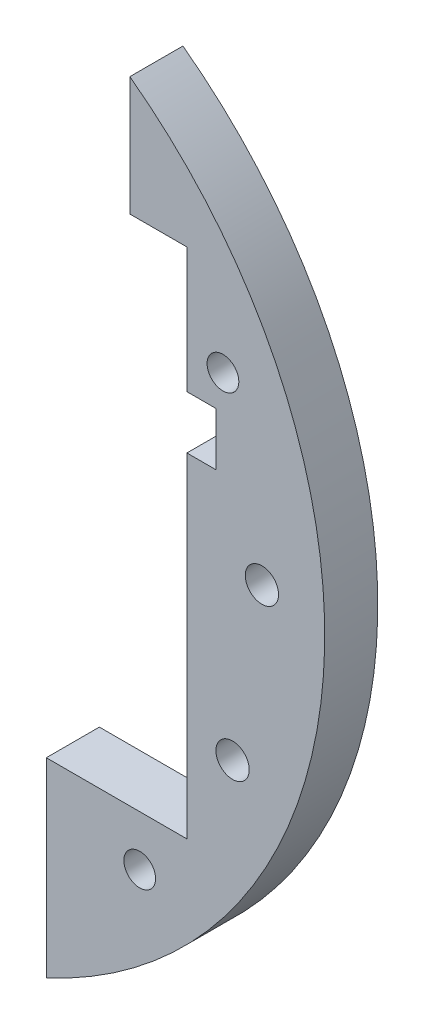
ISO-10303-21;
HEADER;
FILE_DESCRIPTION(('STEP AP214'),'2;1');
FILE_NAME('part.step','',(''),(''),'','','');
FILE_SCHEMA(('AUTOMOTIVE_DESIGN { 1 0 10303 214 1 1 1 1 }'));
ENDSEC;
DATA;
#1=APPLICATION_CONTEXT('core data for automotive mechanical design processes');
#2=APPLICATION_PROTOCOL_DEFINITION('international standard','automotive_design',2000,#1);
#3=PRODUCT_CONTEXT('',#1,'mechanical');
#4=PRODUCT('Part','Part','',(#3));
#5=PRODUCT_RELATED_PRODUCT_CATEGORY('part','',(#4));
#6=PRODUCT_DEFINITION_FORMATION('','',#4);
#7=PRODUCT_DEFINITION_CONTEXT('part definition',#1,'design');
#8=PRODUCT_DEFINITION('design','',#6,#7);
#9=PRODUCT_DEFINITION_SHAPE('','',#8);
#10=(LENGTH_UNIT() NAMED_UNIT(*) SI_UNIT(.MILLI.,.METRE.));
#11=(NAMED_UNIT(*) PLANE_ANGLE_UNIT() SI_UNIT($,.RADIAN.));
#12=(NAMED_UNIT(*) SI_UNIT($,.STERADIAN.) SOLID_ANGLE_UNIT());
#13=UNCERTAINTY_MEASURE_WITH_UNIT(LENGTH_MEASURE(1.E-05),#10,'distance_accuracy_value','');
#14=(GEOMETRIC_REPRESENTATION_CONTEXT(3) GLOBAL_UNCERTAINTY_ASSIGNED_CONTEXT((#13)) GLOBAL_UNIT_ASSIGNED_CONTEXT((#10,
#11,#12)) REPRESENTATION_CONTEXT('',''));
#15=CARTESIAN_POINT('',(0.,0.,0.));
#16=DIRECTION('',(0.,0.,1.));
#17=DIRECTION('',(1.,0.,0.));
#18=AXIS2_PLACEMENT_3D('',#15,#16,#17);
#19=CARTESIAN_POINT('',(41.,32.,6.35));
#20=DIRECTION('',(0.,-1.,0.));
#21=DIRECTION('',(0.,0.,-1.));
#22=AXIS2_PLACEMENT_3D('',#19,#20,#21);
#23=PLANE('',#22);
#24=DIRECTION('',(0.,0.,1.));
#25=VECTOR('',#24,1.);
#26=CARTESIAN_POINT('',(34.175,32.,6.35));
#27=LINE('',#26,#25);
#28=CARTESIAN_POINT('',(34.175,32.,0.));
#29=VERTEX_POINT('',#28);
#30=CARTESIAN_POINT('',(34.175,32.,6.35));
#31=VERTEX_POINT('',#30);
#32=EDGE_CURVE('E43',#29,#31,#27,.T.);
#33=ORIENTED_EDGE('',*,*,#32,.F.);
#34=DIRECTION('',(-1.,0.,0.));
#35=VECTOR('',#34,1.);
#36=CARTESIAN_POINT('',(41.,32.,0.));
#37=LINE('',#36,#35);
#38=CARTESIAN_POINT('',(41.,32.,0.));
#39=VERTEX_POINT('',#38);
#40=EDGE_CURVE('E173',#39,#29,#37,.T.);
#41=ORIENTED_EDGE('',*,*,#40,.F.);
#42=DIRECTION('',(0.,0.,-1.));
#43=VECTOR('',#42,1.);
#44=CARTESIAN_POINT('',(41.,32.,6.35));
#45=LINE('',#44,#43);
#46=CARTESIAN_POINT('',(41.,32.,6.35));
#47=VERTEX_POINT('',#46);
#48=EDGE_CURVE('E170',#47,#39,#45,.T.);
#49=ORIENTED_EDGE('',*,*,#48,.F.);
#50=DIRECTION('',(-1.,0.,0.));
#51=VECTOR('',#50,1.);
#52=CARTESIAN_POINT('',(41.,32.,6.35));
#53=LINE('',#52,#51);
#54=EDGE_CURVE('E172',#47,#31,#53,.T.);
#55=ORIENTED_EDGE('',*,*,#54,.T.);
#56=EDGE_LOOP('',(#33,#41,#49,#55));
#57=FACE_BOUND('',#56,.T.);
#58=ADVANCED_FACE('F35',(#57),#23,.T.);
#59=CARTESIAN_POINT('',(41.,17.,6.35));
#60=DIRECTION('',(-1.,0.,0.));
#61=DIRECTION('',(0.,0.,1.));
#62=AXIS2_PLACEMENT_3D('',#59,#60,#61);
#63=PLANE('',#62);
#64=DIRECTION('',(0.,1.,0.));
#65=VECTOR('',#64,1.);
#66=CARTESIAN_POINT('',(41.,17.,0.));
#67=LINE('',#66,#65);
#68=CARTESIAN_POINT('',(41.,17.,0.));
#69=VERTEX_POINT('',#68);
#70=EDGE_CURVE('E176',#69,#39,#67,.T.);
#71=ORIENTED_EDGE('',*,*,#70,.F.);
#72=DIRECTION('',(0.,0.,-1.));
#73=VECTOR('',#72,1.);
#74=CARTESIAN_POINT('',(41.,17.,6.35));
#75=LINE('',#74,#73);
#76=CARTESIAN_POINT('',(41.,17.,6.35));
#77=VERTEX_POINT('',#76);
#78=EDGE_CURVE('E168',#77,#69,#75,.T.);
#79=ORIENTED_EDGE('',*,*,#78,.F.);
#80=DIRECTION('',(0.,1.,0.));
#81=VECTOR('',#80,1.);
#82=CARTESIAN_POINT('',(41.,17.,6.35));
#83=LINE('',#82,#81);
#84=EDGE_CURVE('E195',#77,#47,#83,.T.);
#85=ORIENTED_EDGE('',*,*,#84,.T.);
#86=ORIENTED_EDGE('',*,*,#48,.T.);
#87=EDGE_LOOP('',(#71,#79,#85,#86));
#88=FACE_BOUND('',#87,.T.);
#89=ADVANCED_FACE('F237',(#88),#63,.T.);
#90=CARTESIAN_POINT('',(44.5,17.,6.35));
#91=DIRECTION('',(0.,-1.,0.));
#92=DIRECTION('',(0.,0.,-1.));
#93=AXIS2_PLACEMENT_3D('',#90,#91,#92);
#94=PLANE('',#93);
#95=DIRECTION('',(-1.,0.,0.));
#96=VECTOR('',#95,1.);
#97=CARTESIAN_POINT('',(44.5,17.,0.));
#98=LINE('',#97,#96);
#99=CARTESIAN_POINT('',(44.5,17.,0.));
#100=VERTEX_POINT('',#99);
#101=EDGE_CURVE('E179',#100,#69,#98,.T.);
#102=ORIENTED_EDGE('',*,*,#101,.F.);
#103=DIRECTION('',(0.,0.,-1.));
#104=VECTOR('',#103,1.);
#105=CARTESIAN_POINT('',(44.5,17.,6.35));
#106=LINE('',#105,#104);
#107=CARTESIAN_POINT('',(44.5,17.,6.35));
#108=VERTEX_POINT('',#107);
#109=EDGE_CURVE('E166',#108,#100,#106,.T.);
#110=ORIENTED_EDGE('',*,*,#109,.F.);
#111=DIRECTION('',(-1.,0.,0.));
#112=VECTOR('',#111,1.);
#113=CARTESIAN_POINT('',(44.5,17.,6.35));
#114=LINE('',#113,#112);
#115=EDGE_CURVE('E197',#108,#77,#114,.T.);
#116=ORIENTED_EDGE('',*,*,#115,.T.);
#117=ORIENTED_EDGE('',*,*,#78,.T.);
#118=EDGE_LOOP('',(#102,#110,#116,#117));
#119=FACE_BOUND('',#118,.T.);
#120=ADVANCED_FACE('F232',(#119),#94,.T.);
#121=CARTESIAN_POINT('',(44.5,10.65,6.35));
#122=DIRECTION('',(-1.,0.,0.));
#123=DIRECTION('',(0.,0.,1.));
#124=AXIS2_PLACEMENT_3D('',#121,#122,#123);
#125=PLANE('',#124);
#126=DIRECTION('',(0.,1.,0.));
#127=VECTOR('',#126,1.);
#128=CARTESIAN_POINT('',(44.5,10.65,0.));
#129=LINE('',#128,#127);
#130=CARTESIAN_POINT('',(44.5,10.65,0.));
#131=VERTEX_POINT('',#130);
#132=EDGE_CURVE('E182',#131,#100,#129,.T.);
#133=ORIENTED_EDGE('',*,*,#132,.F.);
#134=DIRECTION('',(0.,0.,-1.));
#135=VECTOR('',#134,1.);
#136=CARTESIAN_POINT('',(44.5,10.65,6.35));
#137=LINE('',#136,#135);
#138=CARTESIAN_POINT('',(44.5,10.65,6.35));
#139=VERTEX_POINT('',#138);
#140=EDGE_CURVE('E164',#139,#131,#137,.T.);
#141=ORIENTED_EDGE('',*,*,#140,.F.);
#142=DIRECTION('',(0.,1.,0.));
#143=VECTOR('',#142,1.);
#144=CARTESIAN_POINT('',(44.5,10.65,6.35));
#145=LINE('',#144,#143);
#146=EDGE_CURVE('E199',#139,#108,#145,.T.);
#147=ORIENTED_EDGE('',*,*,#146,.T.);
#148=ORIENTED_EDGE('',*,*,#109,.T.);
#149=EDGE_LOOP('',(#133,#141,#147,#148));
#150=FACE_BOUND('',#149,.T.);
#151=ADVANCED_FACE('F227',(#150),#125,.T.);
#152=CARTESIAN_POINT('',(41.,10.65,6.35));
#153=DIRECTION('',(0.,1.,0.));
#154=DIRECTION('',(-1.,0.,0.));
#155=AXIS2_PLACEMENT_3D('',#152,#153,#154);
#156=PLANE('',#155);
#157=DIRECTION('',(1.,0.,0.));
#158=VECTOR('',#157,1.);
#159=CARTESIAN_POINT('',(41.,10.65,0.));
#160=LINE('',#159,#158);
#161=CARTESIAN_POINT('',(41.,10.65,0.));
#162=VERTEX_POINT('',#161);
#163=EDGE_CURVE('E185',#162,#131,#160,.T.);
#164=ORIENTED_EDGE('',*,*,#163,.F.);
#165=DIRECTION('',(0.,0.,-1.));
#166=VECTOR('',#165,1.);
#167=CARTESIAN_POINT('',(41.,10.65,6.35));
#168=LINE('',#167,#166);
#169=CARTESIAN_POINT('',(41.,10.65,6.35));
#170=VERTEX_POINT('',#169);
#171=EDGE_CURVE('E162',#170,#162,#168,.T.);
#172=ORIENTED_EDGE('',*,*,#171,.F.);
#173=DIRECTION('',(1.,0.,0.));
#174=VECTOR('',#173,1.);
#175=CARTESIAN_POINT('',(41.,10.65,6.35));
#176=LINE('',#175,#174);
#177=EDGE_CURVE('E201',#170,#139,#176,.T.);
#178=ORIENTED_EDGE('',*,*,#177,.T.);
#179=ORIENTED_EDGE('',*,*,#140,.T.);
#180=EDGE_LOOP('',(#164,#172,#178,#179));
#181=FACE_BOUND('',#180,.T.);
#182=ADVANCED_FACE('F222',(#181),#156,.T.);
#183=CARTESIAN_POINT('',(45.3153893518326,21.1309130870348,6.35));
#184=DIRECTION('',(0.,0.,-1.));
#185=DIRECTION('',(-1.,0.,0.));
#186=AXIS2_PLACEMENT_3D('',#183,#184,#185);
#187=CYLINDRICAL_SURFACE('',#186,1.89865);
#188=CARTESIAN_POINT('',(45.3153893518326,21.1309130870348,6.35));
#189=DIRECTION('',(0.,0.,1.));
#190=DIRECTION('',(1.,0.,0.));
#191=AXIS2_PLACEMENT_3D('',#188,#189,#190);
#192=CIRCLE('',#191,1.89865);
#193=CARTESIAN_POINT('',(47.2140393518326,21.1309130870348,6.35));
#194=VERTEX_POINT('',#193);
#195=EDGE_CURVE('E133',#194,#194,#192,.T.);
#196=ORIENTED_EDGE('',*,*,#195,.T.);
#197=EDGE_LOOP('',(#196));
#198=FACE_BOUND('',#197,.T.);
#199=CARTESIAN_POINT('',(45.3153893518326,21.1309130870348,0.));
#200=DIRECTION('',(0.,0.,1.));
#201=DIRECTION('',(1.,0.,0.));
#202=AXIS2_PLACEMENT_3D('',#199,#200,#201);
#203=CIRCLE('',#202,1.89865);
#204=CARTESIAN_POINT('',(47.2140393518326,21.1309130870348,0.));
#205=VERTEX_POINT('',#204);
#206=EDGE_CURVE('E136',#205,#205,#203,.T.);
#207=ORIENTED_EDGE('',*,*,#206,.F.);
#208=EDGE_LOOP('',(#207));
#209=FACE_BOUND('',#208,.T.);
#210=ADVANCED_FACE('F267',(#198,#209),#187,.F.);
#211=CARTESIAN_POINT('',(46.4673762113411,-18.4603073656341,6.35));
#212=DIRECTION('',(0.,0.,-1.));
#213=DIRECTION('',(-1.,0.,0.));
#214=AXIS2_PLACEMENT_3D('',#211,#212,#213);
#215=CYLINDRICAL_SURFACE('',#214,1.9939);
#216=CARTESIAN_POINT('',(46.4673762113411,-18.4603073656341,6.35));
#217=DIRECTION('',(0.,0.,1.));
#218=DIRECTION('',(1.,0.,0.));
#219=AXIS2_PLACEMENT_3D('',#216,#217,#218);
#220=CIRCLE('',#219,1.9939);
#221=CARTESIAN_POINT('',(48.4612762113412,-18.4603073656341,6.35));
#222=VERTEX_POINT('',#221);
#223=EDGE_CURVE('E139',#222,#222,#220,.T.);
#224=ORIENTED_EDGE('',*,*,#223,.T.);
#225=EDGE_LOOP('',(#224));
#226=FACE_BOUND('',#225,.T.);
#227=CARTESIAN_POINT('',(46.4673762113411,-18.4603073656341,0.));
#228=DIRECTION('',(0.,0.,1.));
#229=DIRECTION('',(1.,0.,0.));
#230=AXIS2_PLACEMENT_3D('',#227,#228,#229);
#231=CIRCLE('',#230,1.9939);
#232=CARTESIAN_POINT('',(48.4612762113412,-18.4603073656341,0.));
#233=VERTEX_POINT('',#232);
#234=EDGE_CURVE('E142',#233,#233,#231,.T.);
#235=ORIENTED_EDGE('',*,*,#234,.F.);
#236=EDGE_LOOP('',(#235));
#237=FACE_BOUND('',#236,.T.);
#238=ADVANCED_FACE('F273',(#226,#237),#215,.F.);
#239=CARTESIAN_POINT('',(49.97884750411,1.45423593715533,6.35));
#240=DIRECTION('',(0.,0.,-1.));
#241=DIRECTION('',(-1.,0.,0.));
#242=AXIS2_PLACEMENT_3D('',#239,#240,#241);
#243=CYLINDRICAL_SURFACE('',#242,1.9939);
#244=CARTESIAN_POINT('',(49.97884750411,1.45423593715533,6.35));
#245=DIRECTION('',(0.,0.,1.));
#246=DIRECTION('',(1.,0.,0.));
#247=AXIS2_PLACEMENT_3D('',#244,#245,#246);
#248=CIRCLE('',#247,1.9939);
#249=CARTESIAN_POINT('',(51.97274750411,1.45423593715533,6.35));
#250=VERTEX_POINT('',#249);
#251=EDGE_CURVE('E145',#250,#250,#248,.T.);
#252=ORIENTED_EDGE('',*,*,#251,.T.);
#253=EDGE_LOOP('',(#252));
#254=FACE_BOUND('',#253,.T.);
#255=CARTESIAN_POINT('',(49.97884750411,1.45423593715533,0.));
#256=DIRECTION('',(0.,0.,1.));
#257=DIRECTION('',(1.,0.,0.));
#258=AXIS2_PLACEMENT_3D('',#255,#256,#257);
#259=CIRCLE('',#258,1.9939);
#260=CARTESIAN_POINT('',(51.97274750411,1.45423593715533,0.));
#261=VERTEX_POINT('',#260);
#262=EDGE_CURVE('E148',#261,#261,#259,.T.);
#263=ORIENTED_EDGE('',*,*,#262,.F.);
#264=EDGE_LOOP('',(#263));
#265=FACE_BOUND('',#264,.T.);
#266=ADVANCED_FACE('F251',(#254,#265),#243,.F.);
#267=CARTESIAN_POINT('',(35.3553390593274,-35.3553390593274,6.35));
#268=DIRECTION('',(0.,0.,-1.));
#269=DIRECTION('',(-1.,0.,0.));
#270=AXIS2_PLACEMENT_3D('',#267,#268,#269);
#271=CYLINDRICAL_SURFACE('',#270,1.89865);
#272=CARTESIAN_POINT('',(35.3553390593274,-35.3553390593274,6.35));
#273=DIRECTION('',(0.,0.,1.));
#274=DIRECTION('',(1.,0.,0.));
#275=AXIS2_PLACEMENT_3D('',#272,#273,#274);
#276=CIRCLE('',#275,1.89865);
#277=CARTESIAN_POINT('',(37.2539890593274,-35.3553390593274,6.35));
#278=VERTEX_POINT('',#277);
#279=EDGE_CURVE('E151',#278,#278,#276,.T.);
#280=ORIENTED_EDGE('',*,*,#279,.T.);
#281=EDGE_LOOP('',(#280));
#282=FACE_BOUND('',#281,.T.);
#283=CARTESIAN_POINT('',(35.3553390593274,-35.3553390593274,0.));
#284=DIRECTION('',(0.,0.,1.));
#285=DIRECTION('',(1.,0.,0.));
#286=AXIS2_PLACEMENT_3D('',#283,#284,#285);
#287=CIRCLE('',#286,1.89865);
#288=CARTESIAN_POINT('',(37.2539890593274,-35.3553390593274,0.));
#289=VERTEX_POINT('',#288);
#290=EDGE_CURVE('E154',#289,#289,#287,.T.);
#291=ORIENTED_EDGE('',*,*,#290,.F.);
#292=EDGE_LOOP('',(#291));
#293=FACE_BOUND('',#292,.T.);
#294=ADVANCED_FACE('F244',(#282,#293),#271,.F.);
#295=CARTESIAN_POINT('',(34.175,-7.99999999999997,0.));
#296=DIRECTION('',(1.,0.,0.));
#297=DIRECTION('',(0.,0.,-1.));
#298=AXIS2_PLACEMENT_3D('',#295,#296,#297);
#299=PLANE('',#298);
#300=DIRECTION('',(0.,1.,0.));
#301=VECTOR('',#300,1.);
#302=CARTESIAN_POINT('',(34.175,-7.99999999999997,0.));
#303=LINE('',#302,#301);
#304=CARTESIAN_POINT('',(34.175,46.2419655183471,0.));
#305=VERTEX_POINT('',#304);
#306=EDGE_CURVE('E57',#29,#305,#303,.T.);
#307=ORIENTED_EDGE('',*,*,#306,.F.);
#308=ORIENTED_EDGE('',*,*,#32,.T.);
#309=DIRECTION('',(0.,1.,0.));
#310=VECTOR('',#309,1.);
#311=CARTESIAN_POINT('',(34.175,-7.99999999999997,6.35));
#312=LINE('',#311,#310);
#313=CARTESIAN_POINT('',(34.175,46.2419655183471,6.35));
#314=VERTEX_POINT('',#313);
#315=EDGE_CURVE('E117',#31,#314,#312,.T.);
#316=ORIENTED_EDGE('',*,*,#315,.T.);
#317=DIRECTION('',(0.,0.,-1.));
#318=VECTOR('',#317,1.);
#319=CARTESIAN_POINT('',(34.175,46.2419655183471,6.35));
#320=LINE('',#319,#318);
#321=EDGE_CURVE('E130',#305,#314,#320,.F.);
#322=ORIENTED_EDGE('',*,*,#321,.F.);
#323=EDGE_LOOP('',(#307,#308,#316,#322));
#324=FACE_BOUND('',#323,.T.);
#325=ADVANCED_FACE('F242',(#324),#299,.F.);
#326=CARTESIAN_POINT('',(41.,-29.35,6.35));
#327=DIRECTION('',(-1.,0.,0.));
#328=DIRECTION('',(0.,-1.,0.));
#329=AXIS2_PLACEMENT_3D('',#326,#327,#328);
#330=PLANE('',#329);
#331=DIRECTION('',(0.,1.,0.));
#332=VECTOR('',#331,1.);
#333=CARTESIAN_POINT('',(41.,-29.35,0.));
#334=LINE('',#333,#332);
#335=CARTESIAN_POINT('',(41.,-29.35,0.));
#336=VERTEX_POINT('',#335);
#337=EDGE_CURVE('E188',#336,#162,#334,.T.);
#338=ORIENTED_EDGE('',*,*,#337,.F.);
#339=DIRECTION('',(0.,0.,-1.));
#340=VECTOR('',#339,1.);
#341=CARTESIAN_POINT('',(41.,-29.35,6.35));
#342=LINE('',#341,#340);
#343=CARTESIAN_POINT('',(41.,-29.35,6.35));
#344=VERTEX_POINT('',#343);
#345=EDGE_CURVE('E157',#344,#336,#342,.T.);
#346=ORIENTED_EDGE('',*,*,#345,.F.);
#347=DIRECTION('',(0.,1.,0.));
#348=VECTOR('',#347,1.);
#349=CARTESIAN_POINT('',(41.,-29.35,6.35));
#350=LINE('',#349,#348);
#351=EDGE_CURVE('E203',#344,#170,#350,.T.);
#352=ORIENTED_EDGE('',*,*,#351,.T.);
#353=ORIENTED_EDGE('',*,*,#171,.T.);
#354=EDGE_LOOP('',(#338,#346,#352,#353));
#355=FACE_BOUND('',#354,.T.);
#356=ADVANCED_FACE('F217',(#355),#330,.T.);
#357=CARTESIAN_POINT('',(12.5,-29.35,6.35));
#358=DIRECTION('',(0.,1.,0.));
#359=DIRECTION('',(0.,0.,1.));
#360=AXIS2_PLACEMENT_3D('',#357,#358,#359);
#361=PLANE('',#360);
#362=DIRECTION('',(0.,0.,-1.));
#363=VECTOR('',#362,1.);
#364=CARTESIAN_POINT('',(24.175,-29.35,6.35));
#365=LINE('',#364,#363);
#366=CARTESIAN_POINT('',(24.175,-29.35,6.35));
#367=VERTEX_POINT('',#366);
#368=CARTESIAN_POINT('',(24.175,-29.35,0.));
#369=VERTEX_POINT('',#368);
#370=EDGE_CURVE('E11',#367,#369,#365,.T.);
#371=ORIENTED_EDGE('',*,*,#370,.F.);
#372=DIRECTION('',(1.,0.,0.));
#373=VECTOR('',#372,1.);
#374=CARTESIAN_POINT('',(12.5,-29.35,6.35));
#375=LINE('',#374,#373);
#376=EDGE_CURVE('E127',#367,#344,#375,.T.);
#377=ORIENTED_EDGE('',*,*,#376,.T.);
#378=ORIENTED_EDGE('',*,*,#345,.T.);
#379=DIRECTION('',(1.,0.,0.));
#380=VECTOR('',#379,1.);
#381=CARTESIAN_POINT('',(12.5,-29.35,0.));
#382=LINE('',#381,#380);
#383=EDGE_CURVE('E191',#369,#336,#382,.T.);
#384=ORIENTED_EDGE('',*,*,#383,.F.);
#385=EDGE_LOOP('',(#371,#377,#378,#384));
#386=FACE_BOUND('',#385,.T.);
#387=ADVANCED_FACE('F213',(#386),#361,.T.);
#388=CARTESIAN_POINT('',(0.,0.,6.35));
#389=DIRECTION('',(0.,0.,-1.));
#390=DIRECTION('',(-1.,0.,0.));
#391=AXIS2_PLACEMENT_3D('',#388,#389,#390);
#392=CYLINDRICAL_SURFACE('',#391,57.5);
#393=CARTESIAN_POINT('',(0.,0.,6.35));
#394=DIRECTION('',(0.,0.,1.));
#395=DIRECTION('',(1.,0.,0.));
#396=AXIS2_PLACEMENT_3D('',#393,#394,#395);
#397=CIRCLE('',#396,57.5);
#398=CARTESIAN_POINT('',(24.175,-52.1710587874158,6.35));
#399=VERTEX_POINT('',#398);
#400=EDGE_CURVE('E124',#399,#314,#397,.T.);
#401=ORIENTED_EDGE('',*,*,#400,.F.);
#402=DIRECTION('',(0.,0.,-1.));
#403=VECTOR('',#402,1.);
#404=CARTESIAN_POINT('',(24.175,-52.1710587874158,6.35));
#405=LINE('',#404,#403);
#406=CARTESIAN_POINT('',(24.175,-52.1710587874158,0.));
#407=VERTEX_POINT('',#406);
#408=EDGE_CURVE('E110',#399,#407,#405,.T.);
#409=ORIENTED_EDGE('',*,*,#408,.T.);
#410=CARTESIAN_POINT('',(0.,0.,0.));
#411=DIRECTION('',(0.,0.,1.));
#412=DIRECTION('',(1.,0.,0.));
#413=AXIS2_PLACEMENT_3D('',#410,#411,#412);
#414=CIRCLE('',#413,57.5);
#415=EDGE_CURVE('E131',#407,#305,#414,.T.);
#416=ORIENTED_EDGE('',*,*,#415,.T.);
#417=ORIENTED_EDGE('',*,*,#321,.T.);
#418=EDGE_LOOP('',(#401,#409,#416,#417));
#419=FACE_BOUND('',#418,.T.);
#420=ADVANCED_FACE('F37',(#419),#392,.T.);
#421=CARTESIAN_POINT('',(0.,0.,0.));
#422=DIRECTION('',(0.,0.,1.));
#423=DIRECTION('',(1.,0.,0.));
#424=AXIS2_PLACEMENT_3D('',#421,#422,#423);
#425=PLANE('',#424);
#426=ORIENTED_EDGE('',*,*,#290,.T.);
#427=EDGE_LOOP('',(#426));
#428=FACE_BOUND('',#427,.T.);
#429=ORIENTED_EDGE('',*,*,#262,.T.);
#430=EDGE_LOOP('',(#429));
#431=FACE_BOUND('',#430,.T.);
#432=ORIENTED_EDGE('',*,*,#234,.T.);
#433=EDGE_LOOP('',(#432));
#434=FACE_BOUND('',#433,.T.);
#435=ORIENTED_EDGE('',*,*,#206,.T.);
#436=EDGE_LOOP('',(#435));
#437=FACE_BOUND('',#436,.T.);
#438=ORIENTED_EDGE('',*,*,#415,.F.);
#439=DIRECTION('',(0.,1.,0.));
#440=VECTOR('',#439,1.);
#441=CARTESIAN_POINT('',(24.175,-16.4702777548376,0.));
#442=LINE('',#441,#440);
#443=EDGE_CURVE('E113',#407,#369,#442,.T.);
#444=ORIENTED_EDGE('',*,*,#443,.T.);
#445=ORIENTED_EDGE('',*,*,#383,.T.);
#446=ORIENTED_EDGE('',*,*,#337,.T.);
#447=ORIENTED_EDGE('',*,*,#163,.T.);
#448=ORIENTED_EDGE('',*,*,#132,.T.);
#449=ORIENTED_EDGE('',*,*,#101,.T.);
#450=ORIENTED_EDGE('',*,*,#70,.T.);
#451=ORIENTED_EDGE('',*,*,#40,.T.);
#452=ORIENTED_EDGE('',*,*,#306,.T.);
#453=EDGE_LOOP('',(#438,#444,#445,#446,#447,#448,#449,#450,#451,#452));
#454=FACE_BOUND('',#453,.T.);
#455=ADVANCED_FACE('F211',(#428,#431,#434,#437,#454),#425,.F.);
#456=CARTESIAN_POINT('',(0.,0.,6.35));
#457=DIRECTION('',(0.,0.,1.));
#458=DIRECTION('',(1.,0.,0.));
#459=AXIS2_PLACEMENT_3D('',#456,#457,#458);
#460=PLANE('',#459);
#461=DIRECTION('',(0.,1.,0.));
#462=VECTOR('',#461,1.);
#463=CARTESIAN_POINT('',(24.175,-16.4702777548376,6.35));
#464=LINE('',#463,#462);
#465=EDGE_CURVE('E49',#399,#367,#464,.T.);
#466=ORIENTED_EDGE('',*,*,#465,.F.);
#467=ORIENTED_EDGE('',*,*,#400,.T.);
#468=ORIENTED_EDGE('',*,*,#315,.F.);
#469=ORIENTED_EDGE('',*,*,#54,.F.);
#470=ORIENTED_EDGE('',*,*,#84,.F.);
#471=ORIENTED_EDGE('',*,*,#115,.F.);
#472=ORIENTED_EDGE('',*,*,#146,.F.);
#473=ORIENTED_EDGE('',*,*,#177,.F.);
#474=ORIENTED_EDGE('',*,*,#351,.F.);
#475=ORIENTED_EDGE('',*,*,#376,.F.);
#476=EDGE_LOOP('',(#466,#467,#468,#469,#470,#471,#472,#473,#474,#475));
#477=FACE_BOUND('',#476,.T.);
#478=ORIENTED_EDGE('',*,*,#251,.F.);
#479=EDGE_LOOP('',(#478));
#480=FACE_BOUND('',#479,.T.);
#481=ORIENTED_EDGE('',*,*,#223,.F.);
#482=EDGE_LOOP('',(#481));
#483=FACE_BOUND('',#482,.T.);
#484=ORIENTED_EDGE('',*,*,#195,.F.);
#485=EDGE_LOOP('',(#484));
#486=FACE_BOUND('',#485,.T.);
#487=ORIENTED_EDGE('',*,*,#279,.F.);
#488=EDGE_LOOP('',(#487));
#489=FACE_BOUND('',#488,.T.);
#490=ADVANCED_FACE('F121',(#477,#480,#483,#486,#489),#460,.T.);
#491=CARTESIAN_POINT('',(24.175,-16.4702777548376,0.));
#492=DIRECTION('',(1.,0.,0.));
#493=DIRECTION('',(0.,1.,0.));
#494=AXIS2_PLACEMENT_3D('',#491,#492,#493);
#495=PLANE('',#494);
#496=ORIENTED_EDGE('',*,*,#465,.T.);
#497=ORIENTED_EDGE('',*,*,#370,.T.);
#498=ORIENTED_EDGE('',*,*,#443,.F.);
#499=ORIENTED_EDGE('',*,*,#408,.F.);
#500=EDGE_LOOP('',(#496,#497,#498,#499));
#501=FACE_BOUND('',#500,.T.);
#502=ADVANCED_FACE('F111',(#501),#495,.F.);
#503=CLOSED_SHELL('',(#58,#89,#120,#151,#182,#210,#238,#266,#294,#325,#356,#387,#420,#455,#490,#502));
#504=MANIFOLD_SOLID_BREP('B2',#503);
#505=ADVANCED_BREP_SHAPE_REPRESENTATION('',(#18,#504),#14);
#506=SHAPE_DEFINITION_REPRESENTATION(#9,#505);
ENDSEC;
END-ISO-10303-21;
